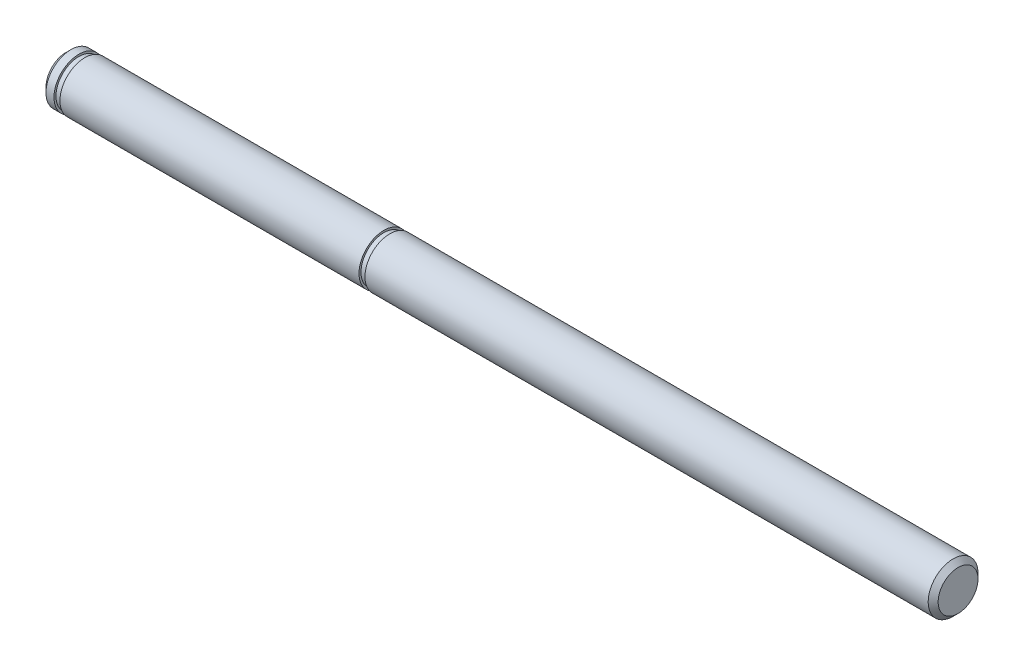
ISO-10303-21;
HEADER;
FILE_DESCRIPTION(('STEP AP214'),'2;1');
FILE_NAME('part.step','',(''),(''),'','','');
FILE_SCHEMA(('AUTOMOTIVE_DESIGN { 1 0 10303 214 1 1 1 1 }'));
ENDSEC;
DATA;
#1=APPLICATION_CONTEXT('core data for automotive mechanical design processes');
#2=APPLICATION_PROTOCOL_DEFINITION('international standard','automotive_design',2000,#1);
#3=PRODUCT_CONTEXT('',#1,'mechanical');
#4=PRODUCT('Part','Part','',(#3));
#5=PRODUCT_RELATED_PRODUCT_CATEGORY('part','',(#4));
#6=PRODUCT_DEFINITION_FORMATION('','',#4);
#7=PRODUCT_DEFINITION_CONTEXT('part definition',#1,'design');
#8=PRODUCT_DEFINITION('design','',#6,#7);
#9=PRODUCT_DEFINITION_SHAPE('','',#8);
#10=(LENGTH_UNIT() NAMED_UNIT(*) SI_UNIT(.MILLI.,.METRE.));
#11=(NAMED_UNIT(*) PLANE_ANGLE_UNIT() SI_UNIT($,.RADIAN.));
#12=(NAMED_UNIT(*) SI_UNIT($,.STERADIAN.) SOLID_ANGLE_UNIT());
#13=UNCERTAINTY_MEASURE_WITH_UNIT(LENGTH_MEASURE(1.E-05),#10,'distance_accuracy_value','');
#14=(GEOMETRIC_REPRESENTATION_CONTEXT(3) GLOBAL_UNCERTAINTY_ASSIGNED_CONTEXT((#13)) GLOBAL_UNIT_ASSIGNED_CONTEXT((#10,
#11,#12)) REPRESENTATION_CONTEXT('',''));
#15=CARTESIAN_POINT('',(0.,0.,0.));
#16=DIRECTION('',(0.,0.,1.));
#17=DIRECTION('',(1.,0.,0.));
#18=AXIS2_PLACEMENT_3D('',#15,#16,#17);
#19=CARTESIAN_POINT('',(113.665,0.,0.));
#20=DIRECTION('',(-1.,0.,0.));
#21=DIRECTION('',(0.,0.,1.));
#22=AXIS2_PLACEMENT_3D('',#19,#20,#21);
#23=CYLINDRICAL_SURFACE('',#22,3.175);
#24=CARTESIAN_POINT('',(0.635000000000011,0.,0.));
#25=DIRECTION('',(1.,0.,0.));
#26=DIRECTION('',(0.,0.,-1.));
#27=AXIS2_PLACEMENT_3D('',#24,#25,#26);
#28=CIRCLE('',#27,3.175);
#29=CARTESIAN_POINT('',(0.635000000000011,0.,-3.175));
#30=VERTEX_POINT('',#29);
#31=EDGE_CURVE('E59',#30,#30,#28,.T.);
#32=ORIENTED_EDGE('',*,*,#31,.T.);
#33=EDGE_LOOP('',(#32));
#34=FACE_BOUND('',#33,.T.);
#35=CARTESIAN_POINT('',(1.651,0.,0.));
#36=DIRECTION('',(-1.,0.,0.));
#37=DIRECTION('',(0.,0.,1.));
#38=AXIS2_PLACEMENT_3D('',#35,#36,#37);
#39=CIRCLE('',#38,3.175);
#40=CARTESIAN_POINT('',(1.651,0.,3.175));
#41=VERTEX_POINT('',#40);
#42=EDGE_CURVE('E95',#41,#41,#39,.T.);
#43=ORIENTED_EDGE('',*,*,#42,.T.);
#44=EDGE_LOOP('',(#43));
#45=FACE_BOUND('',#44,.T.);
#46=ADVANCED_FACE('F45',(#34,#45),#23,.T.);
#47=CARTESIAN_POINT('',(0.,0.,0.));
#48=DIRECTION('',(1.,0.,0.));
#49=DIRECTION('',(0.,0.,-1.));
#50=AXIS2_PLACEMENT_3D('',#47,#48,#49);
#51=PLANE('',#50);
#52=CARTESIAN_POINT('',(0.,0.,0.));
#53=DIRECTION('',(1.,0.,0.));
#54=DIRECTION('',(0.,0.,-1.));
#55=AXIS2_PLACEMENT_3D('',#52,#53,#54);
#56=CIRCLE('',#55,2.53999999999999);
#57=CARTESIAN_POINT('',(0.,0.,-2.53999999999999));
#58=VERTEX_POINT('',#57);
#59=EDGE_CURVE('E10',#58,#58,#56,.F.);
#60=ORIENTED_EDGE('',*,*,#59,.T.);
#61=EDGE_LOOP('',(#60));
#62=FACE_BOUND('',#61,.T.);
#63=ADVANCED_FACE('F125',(#62),#51,.F.);
#64=CARTESIAN_POINT('',(0.635000000000011,0.,0.));
#65=DIRECTION('',(1.,0.,0.));
#66=DIRECTION('',(0.,0.,-1.));
#67=AXIS2_PLACEMENT_3D('',#64,#65,#66);
#68=CONICAL_SURFACE('',#67,3.175,0.78539816339745);
#69=ORIENTED_EDGE('',*,*,#59,.F.);
#70=EDGE_LOOP('',(#69));
#71=FACE_BOUND('',#70,.T.);
#72=ORIENTED_EDGE('',*,*,#31,.F.);
#73=EDGE_LOOP('',(#72));
#74=FACE_BOUND('',#73,.T.);
#75=ADVANCED_FACE('F48',(#71,#74),#68,.T.);
#76=CARTESIAN_POINT('',(2.413,2.921,0.));
#77=DIRECTION('',(-1.,0.,0.));
#78=DIRECTION('',(0.,0.,1.));
#79=AXIS2_PLACEMENT_3D('',#76,#77,#78);
#80=PLANE('',#79);
#81=CARTESIAN_POINT('',(2.413,0.,0.));
#82=DIRECTION('',(-1.,0.,0.));
#83=DIRECTION('',(0.,0.,1.));
#84=AXIS2_PLACEMENT_3D('',#81,#82,#83);
#85=CIRCLE('',#84,3.175);
#86=CARTESIAN_POINT('',(2.413,0.,3.175));
#87=VERTEX_POINT('',#86);
#88=EDGE_CURVE('E75',#87,#87,#85,.T.);
#89=ORIENTED_EDGE('',*,*,#88,.T.);
#90=EDGE_LOOP('',(#89));
#91=FACE_BOUND('',#90,.T.);
#92=CARTESIAN_POINT('',(2.413,0.,0.));
#93=DIRECTION('',(-1.,0.,0.));
#94=DIRECTION('',(0.,0.,1.));
#95=AXIS2_PLACEMENT_3D('',#92,#93,#94);
#96=CIRCLE('',#95,2.921);
#97=CARTESIAN_POINT('',(2.413,0.,2.921));
#98=VERTEX_POINT('',#97);
#99=EDGE_CURVE('E70',#98,#98,#96,.T.);
#100=ORIENTED_EDGE('',*,*,#99,.F.);
#101=EDGE_LOOP('',(#100));
#102=FACE_BOUND('',#101,.T.);
#103=ADVANCED_FACE('F103',(#91,#102),#80,.T.);
#104=CARTESIAN_POINT('',(0.,0.,0.));
#105=DIRECTION('',(-1.,0.,0.));
#106=DIRECTION('',(0.,0.,1.));
#107=AXIS2_PLACEMENT_3D('',#104,#105,#106);
#108=CYLINDRICAL_SURFACE('',#107,2.921);
#109=ORIENTED_EDGE('',*,*,#99,.T.);
#110=EDGE_LOOP('',(#109));
#111=FACE_BOUND('',#110,.T.);
#112=CARTESIAN_POINT('',(1.651,0.,0.));
#113=DIRECTION('',(-1.,0.,0.));
#114=DIRECTION('',(0.,0.,1.));
#115=AXIS2_PLACEMENT_3D('',#112,#113,#114);
#116=CIRCLE('',#115,2.921);
#117=CARTESIAN_POINT('',(1.651,0.,2.921));
#118=VERTEX_POINT('',#117);
#119=EDGE_CURVE('E91',#118,#118,#116,.T.);
#120=ORIENTED_EDGE('',*,*,#119,.F.);
#121=EDGE_LOOP('',(#120));
#122=FACE_BOUND('',#121,.T.);
#123=ADVANCED_FACE('F120',(#111,#122),#108,.T.);
#124=CARTESIAN_POINT('',(1.651,2.921,0.));
#125=DIRECTION('',(1.,0.,0.));
#126=DIRECTION('',(0.,0.,-1.));
#127=AXIS2_PLACEMENT_3D('',#124,#125,#126);
#128=PLANE('',#127);
#129=ORIENTED_EDGE('',*,*,#119,.T.);
#130=EDGE_LOOP('',(#129));
#131=FACE_BOUND('',#130,.T.);
#132=ORIENTED_EDGE('',*,*,#42,.F.);
#133=EDGE_LOOP('',(#132));
#134=FACE_BOUND('',#133,.T.);
#135=ADVANCED_FACE('F109',(#131,#134),#128,.T.);
#136=CARTESIAN_POINT('',(40.513,0.,0.));
#137=DIRECTION('',(-1.,0.,0.));
#138=DIRECTION('',(0.,0.,1.));
#139=AXIS2_PLACEMENT_3D('',#136,#137,#138);
#140=CIRCLE('',#139,3.175);
#141=CARTESIAN_POINT('',(40.513,0.,3.175));
#142=VERTEX_POINT('',#141);
#143=EDGE_CURVE('E84',#142,#142,#140,.T.);
#144=ORIENTED_EDGE('',*,*,#143,.T.);
#145=EDGE_LOOP('',(#144));
#146=FACE_BOUND('',#145,.T.);
#147=ORIENTED_EDGE('',*,*,#88,.F.);
#148=EDGE_LOOP('',(#147));
#149=FACE_BOUND('',#148,.T.);
#150=ADVANCED_FACE('F106',(#146,#149),#23,.T.);
#151=CARTESIAN_POINT('',(41.275,2.921,0.));
#152=DIRECTION('',(-1.,0.,0.));
#153=DIRECTION('',(0.,0.,1.));
#154=AXIS2_PLACEMENT_3D('',#151,#152,#153);
#155=PLANE('',#154);
#156=CARTESIAN_POINT('',(41.275,0.,0.));
#157=DIRECTION('',(-1.,0.,0.));
#158=DIRECTION('',(0.,0.,1.));
#159=AXIS2_PLACEMENT_3D('',#156,#157,#158);
#160=CIRCLE('',#159,3.175);
#161=CARTESIAN_POINT('',(41.275,0.,3.175));
#162=VERTEX_POINT('',#161);
#163=EDGE_CURVE('E71',#162,#162,#160,.T.);
#164=ORIENTED_EDGE('',*,*,#163,.T.);
#165=EDGE_LOOP('',(#164));
#166=FACE_BOUND('',#165,.T.);
#167=CARTESIAN_POINT('',(41.275,0.,0.));
#168=DIRECTION('',(-1.,0.,0.));
#169=DIRECTION('',(0.,0.,1.));
#170=AXIS2_PLACEMENT_3D('',#167,#168,#169);
#171=CIRCLE('',#170,2.921);
#172=CARTESIAN_POINT('',(41.275,0.,2.921));
#173=VERTEX_POINT('',#172);
#174=EDGE_CURVE('E76',#173,#173,#171,.T.);
#175=ORIENTED_EDGE('',*,*,#174,.F.);
#176=EDGE_LOOP('',(#175));
#177=FACE_BOUND('',#176,.T.);
#178=ADVANCED_FACE('F108',(#166,#177),#155,.T.);
#179=CARTESIAN_POINT('',(0.,0.,0.));
#180=DIRECTION('',(-1.,0.,0.));
#181=DIRECTION('',(0.,0.,1.));
#182=AXIS2_PLACEMENT_3D('',#179,#180,#181);
#183=CYLINDRICAL_SURFACE('',#182,2.921);
#184=ORIENTED_EDGE('',*,*,#174,.T.);
#185=EDGE_LOOP('',(#184));
#186=FACE_BOUND('',#185,.T.);
#187=CARTESIAN_POINT('',(40.513,0.,0.));
#188=DIRECTION('',(-1.,0.,0.));
#189=DIRECTION('',(0.,0.,1.));
#190=AXIS2_PLACEMENT_3D('',#187,#188,#189);
#191=CIRCLE('',#190,2.921);
#192=CARTESIAN_POINT('',(40.513,0.,2.921));
#193=VERTEX_POINT('',#192);
#194=EDGE_CURVE('E80',#193,#193,#191,.T.);
#195=ORIENTED_EDGE('',*,*,#194,.F.);
#196=EDGE_LOOP('',(#195));
#197=FACE_BOUND('',#196,.T.);
#198=ADVANCED_FACE('F117',(#186,#197),#183,.T.);
#199=CARTESIAN_POINT('',(40.513,2.921,0.));
#200=DIRECTION('',(1.,0.,0.));
#201=DIRECTION('',(0.,0.,-1.));
#202=AXIS2_PLACEMENT_3D('',#199,#200,#201);
#203=PLANE('',#202);
#204=ORIENTED_EDGE('',*,*,#194,.T.);
#205=EDGE_LOOP('',(#204));
#206=FACE_BOUND('',#205,.T.);
#207=ORIENTED_EDGE('',*,*,#143,.F.);
#208=EDGE_LOOP('',(#207));
#209=FACE_BOUND('',#208,.T.);
#210=ADVANCED_FACE('F142',(#206,#209),#203,.T.);
#211=CARTESIAN_POINT('',(113.665,0.,0.));
#212=DIRECTION('',(1.,0.,0.));
#213=DIRECTION('',(0.,0.,-1.));
#214=AXIS2_PLACEMENT_3D('',#211,#212,#213);
#215=PLANE('',#214);
#216=CARTESIAN_POINT('',(113.665,0.,0.));
#217=DIRECTION('',(1.,0.,0.));
#218=DIRECTION('',(0.,0.,-1.));
#219=AXIS2_PLACEMENT_3D('',#216,#217,#218);
#220=CIRCLE('',#219,2.54);
#221=CARTESIAN_POINT('',(113.665,0.,-2.54));
#222=VERTEX_POINT('',#221);
#223=EDGE_CURVE('E64',#222,#222,#220,.T.);
#224=ORIENTED_EDGE('',*,*,#223,.T.);
#225=EDGE_LOOP('',(#224));
#226=FACE_BOUND('',#225,.T.);
#227=ADVANCED_FACE('F133',(#226),#215,.T.);
#228=CARTESIAN_POINT('',(113.665,0.,0.));
#229=DIRECTION('',(-1.,0.,0.));
#230=DIRECTION('',(0.,0.,1.));
#231=AXIS2_PLACEMENT_3D('',#228,#229,#230);
#232=CONICAL_SURFACE('',#231,2.54,0.78539816339745);
#233=CARTESIAN_POINT('',(113.03,0.,0.));
#234=DIRECTION('',(1.,0.,0.));
#235=DIRECTION('',(0.,0.,-1.));
#236=AXIS2_PLACEMENT_3D('',#233,#234,#235);
#237=CIRCLE('',#236,3.175);
#238=CARTESIAN_POINT('',(113.03,0.,-3.175));
#239=VERTEX_POINT('',#238);
#240=EDGE_CURVE('E54',#239,#239,#237,.F.);
#241=ORIENTED_EDGE('',*,*,#240,.F.);
#242=EDGE_LOOP('',(#241));
#243=FACE_BOUND('',#242,.T.);
#244=ORIENTED_EDGE('',*,*,#223,.F.);
#245=EDGE_LOOP('',(#244));
#246=FACE_BOUND('',#245,.T.);
#247=ADVANCED_FACE('F128',(#243,#246),#232,.T.);
#248=ORIENTED_EDGE('',*,*,#240,.T.);
#249=EDGE_LOOP('',(#248));
#250=FACE_BOUND('',#249,.T.);
#251=ORIENTED_EDGE('',*,*,#163,.F.);
#252=EDGE_LOOP('',(#251));
#253=FACE_BOUND('',#252,.T.);
#254=ADVANCED_FACE('F112',(#250,#253),#23,.T.);
#255=CLOSED_SHELL('',(#46,#63,#75,#103,#123,#135,#150,#178,#198,#210,#227,#247,#254));
#256=MANIFOLD_SOLID_BREP('B2',#255);
#257=ADVANCED_BREP_SHAPE_REPRESENTATION('',(#18,#256),#14);
#258=SHAPE_DEFINITION_REPRESENTATION(#9,#257);
ENDSEC;
END-ISO-10303-21;
